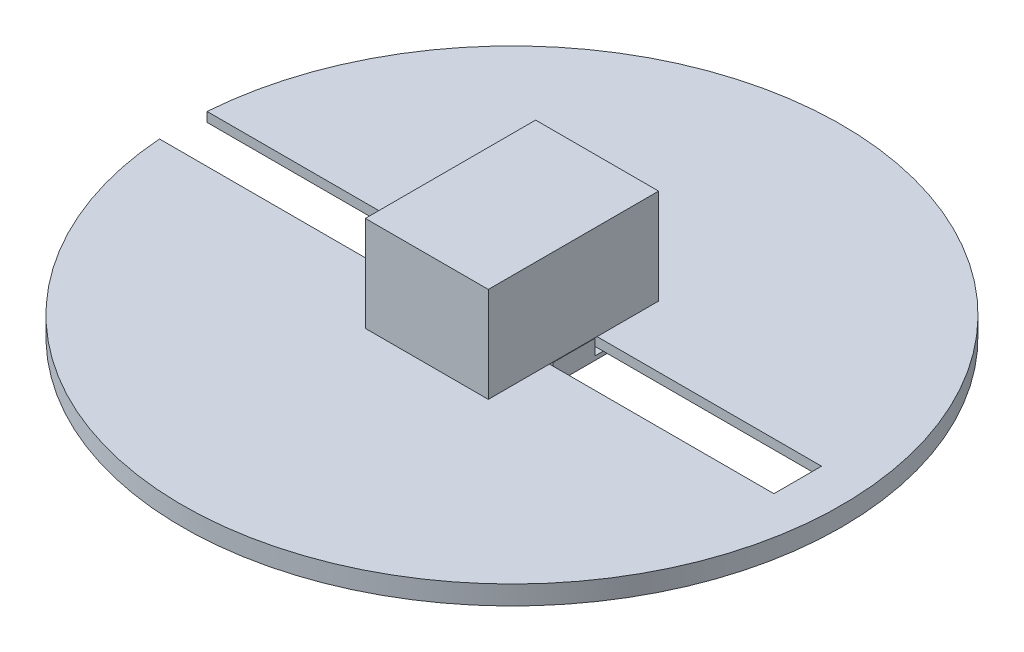
ISO-10303-21;
HEADER;
FILE_DESCRIPTION(('STEP AP214'),'2;1');
FILE_NAME('part.step','',(''),(''),'','','');
FILE_SCHEMA(('AUTOMOTIVE_DESIGN { 1 0 10303 214 1 1 1 1 }'));
ENDSEC;
DATA;
#1=APPLICATION_CONTEXT('core data for automotive mechanical design processes');
#2=APPLICATION_PROTOCOL_DEFINITION('international standard','automotive_design',2000,#1);
#3=PRODUCT_CONTEXT('',#1,'mechanical');
#4=PRODUCT('Part','Part','',(#3));
#5=PRODUCT_RELATED_PRODUCT_CATEGORY('part','',(#4));
#6=PRODUCT_DEFINITION_FORMATION('','',#4);
#7=PRODUCT_DEFINITION_CONTEXT('part definition',#1,'design');
#8=PRODUCT_DEFINITION('design','',#6,#7);
#9=PRODUCT_DEFINITION_SHAPE('','',#8);
#10=(LENGTH_UNIT() NAMED_UNIT(*) SI_UNIT(.MILLI.,.METRE.));
#11=(NAMED_UNIT(*) PLANE_ANGLE_UNIT() SI_UNIT($,.RADIAN.));
#12=(NAMED_UNIT(*) SI_UNIT($,.STERADIAN.) SOLID_ANGLE_UNIT());
#13=UNCERTAINTY_MEASURE_WITH_UNIT(LENGTH_MEASURE(1.E-05),#10,'distance_accuracy_value','');
#14=(GEOMETRIC_REPRESENTATION_CONTEXT(3) GLOBAL_UNCERTAINTY_ASSIGNED_CONTEXT((#13)) GLOBAL_UNIT_ASSIGNED_CONTEXT((#10,
#11,#12)) REPRESENTATION_CONTEXT('',''));
#15=CARTESIAN_POINT('',(0.,0.,0.));
#16=DIRECTION('',(0.,0.,1.));
#17=DIRECTION('',(1.,0.,0.));
#18=AXIS2_PLACEMENT_3D('',#15,#16,#17);
#19=CARTESIAN_POINT('',(-6.5,2.02164096303692,0.));
#20=DIRECTION('',(0.,1.,0.));
#21=DIRECTION('',(0.,0.,1.));
#22=AXIS2_PLACEMENT_3D('',#19,#20,#21);
#23=PLANE('',#22);
#24=DIRECTION('',(0.,0.,1.));
#25=VECTOR('',#24,1.);
#26=CARTESIAN_POINT('',(-6.45681258730333,2.02164096303692,-8.94020204395845));
#27=LINE('',#26,#25);
#28=CARTESIAN_POINT('',(-6.45681258730333,2.02164096303692,-2.2));
#29=VERTEX_POINT('',#28);
#30=CARTESIAN_POINT('',(-6.45681258730333,2.02164096303692,2.2));
#31=VERTEX_POINT('',#30);
#32=EDGE_CURVE('E12',#29,#31,#27,.T.);
#33=ORIENTED_EDGE('',*,*,#32,.F.);
#34=DIRECTION('',(1.,0.,0.));
#35=VECTOR('',#34,1.);
#36=CARTESIAN_POINT('',(-6.5,2.02164096303692,-2.2));
#37=LINE('',#36,#35);
#38=CARTESIAN_POINT('',(-6.5,2.02164096303692,-2.2));
#39=VERTEX_POINT('',#38);
#40=EDGE_CURVE('E243',#39,#29,#37,.T.);
#41=ORIENTED_EDGE('',*,*,#40,.F.);
#42=DIRECTION('',(0.,0.,1.));
#43=VECTOR('',#42,1.);
#44=CARTESIAN_POINT('',(-6.5,2.02164096303692,0.));
#45=LINE('',#44,#43);
#46=CARTESIAN_POINT('',(-6.5,2.02164096303692,2.2));
#47=VERTEX_POINT('',#46);
#48=EDGE_CURVE('E216',#39,#47,#45,.T.);
#49=ORIENTED_EDGE('',*,*,#48,.T.);
#50=DIRECTION('',(1.,0.,0.));
#51=VECTOR('',#50,1.);
#52=CARTESIAN_POINT('',(-6.5,2.02164096303692,2.2));
#53=LINE('',#52,#51);
#54=EDGE_CURVE('E239',#47,#31,#53,.T.);
#55=ORIENTED_EDGE('',*,*,#54,.T.);
#56=EDGE_LOOP('',(#33,#41,#49,#55));
#57=FACE_BOUND('',#56,.T.);
#58=ADVANCED_FACE('F49',(#57),#23,.T.);
#59=CARTESIAN_POINT('',(-6.5,0.,-7.2));
#60=DIRECTION('',(0.,0.,-1.));
#61=DIRECTION('',(-1.,0.,0.));
#62=AXIS2_PLACEMENT_3D('',#59,#60,#61);
#63=PLANE('',#62);
#64=DIRECTION('',(1.,0.,0.));
#65=VECTOR('',#64,1.);
#66=CARTESIAN_POINT('',(-6.5,0.421640963036902,-7.2));
#67=LINE('',#66,#65);
#68=CARTESIAN_POINT('',(-6.5,0.421640963036902,-7.2));
#69=VERTEX_POINT('',#68);
#70=CARTESIAN_POINT('',(6.5,0.421640963036902,-7.2));
#71=VERTEX_POINT('',#70);
#72=EDGE_CURVE('E53',#69,#71,#67,.T.);
#73=ORIENTED_EDGE('',*,*,#72,.T.);
#74=DIRECTION('',(0.,1.,0.));
#75=VECTOR('',#74,1.);
#76=CARTESIAN_POINT('',(6.5,0.,-7.2));
#77=LINE('',#76,#75);
#78=CARTESIAN_POINT('',(6.5,0.,-7.2));
#79=VERTEX_POINT('',#78);
#80=EDGE_CURVE('E178',#79,#71,#77,.T.);
#81=ORIENTED_EDGE('',*,*,#80,.F.);
#82=DIRECTION('',(1.,0.,0.));
#83=VECTOR('',#82,1.);
#84=CARTESIAN_POINT('',(-6.5,0.,-7.2));
#85=LINE('',#84,#83);
#86=CARTESIAN_POINT('',(-6.5,0.,-7.2));
#87=VERTEX_POINT('',#86);
#88=EDGE_CURVE('E231',#87,#79,#85,.T.);
#89=ORIENTED_EDGE('',*,*,#88,.F.);
#90=DIRECTION('',(0.,1.,0.));
#91=VECTOR('',#90,1.);
#92=CARTESIAN_POINT('',(-6.5,0.,-7.2));
#93=LINE('',#92,#91);
#94=EDGE_CURVE('E207',#87,#69,#93,.T.);
#95=ORIENTED_EDGE('',*,*,#94,.T.);
#96=EDGE_LOOP('',(#73,#81,#89,#95));
#97=FACE_BOUND('',#96,.T.);
#98=ADVANCED_FACE('F51',(#97),#63,.T.);
#99=CARTESIAN_POINT('',(-6.5,0.,0.));
#100=DIRECTION('',(0.,-1.,0.));
#101=DIRECTION('',(0.,0.,-1.));
#102=AXIS2_PLACEMENT_3D('',#99,#100,#101);
#103=PLANE('',#102);
#104=ORIENTED_EDGE('',*,*,#88,.T.);
#105=DIRECTION('',(0.,0.,-1.));
#106=VECTOR('',#105,1.);
#107=CARTESIAN_POINT('',(6.5,0.,0.));
#108=LINE('',#107,#106);
#109=CARTESIAN_POINT('',(6.5,0.,7.2));
#110=VERTEX_POINT('',#109);
#111=EDGE_CURVE('E204',#110,#79,#108,.T.);
#112=ORIENTED_EDGE('',*,*,#111,.F.);
#113=DIRECTION('',(1.,0.,0.));
#114=VECTOR('',#113,1.);
#115=CARTESIAN_POINT('',(-6.5,0.,7.2));
#116=LINE('',#115,#114);
#117=CARTESIAN_POINT('',(-6.5,0.,7.2));
#118=VERTEX_POINT('',#117);
#119=EDGE_CURVE('E233',#118,#110,#116,.T.);
#120=ORIENTED_EDGE('',*,*,#119,.F.);
#121=DIRECTION('',(0.,0.,-1.));
#122=VECTOR('',#121,1.);
#123=CARTESIAN_POINT('',(-6.5,0.,0.));
#124=LINE('',#123,#122);
#125=EDGE_CURVE('E228',#118,#87,#124,.T.);
#126=ORIENTED_EDGE('',*,*,#125,.T.);
#127=EDGE_LOOP('',(#104,#112,#120,#126));
#128=FACE_BOUND('',#127,.T.);
#129=ADVANCED_FACE('F260',(#128),#103,.T.);
#130=CARTESIAN_POINT('',(-6.5,0.,7.2));
#131=DIRECTION('',(0.,0.,1.));
#132=DIRECTION('',(1.,0.,0.));
#133=AXIS2_PLACEMENT_3D('',#130,#131,#132);
#134=PLANE('',#133);
#135=ORIENTED_EDGE('',*,*,#119,.T.);
#136=DIRECTION('',(0.,-1.,0.));
#137=VECTOR('',#136,1.);
#138=CARTESIAN_POINT('',(6.5,0.,7.2));
#139=LINE('',#138,#137);
#140=CARTESIAN_POINT('',(6.5,0.421640963036901,7.2));
#141=VERTEX_POINT('',#140);
#142=EDGE_CURVE('E201',#141,#110,#139,.T.);
#143=ORIENTED_EDGE('',*,*,#142,.F.);
#144=DIRECTION('',(1.,0.,0.));
#145=VECTOR('',#144,1.);
#146=CARTESIAN_POINT('',(-6.5,0.421640963036901,7.2));
#147=LINE('',#146,#145);
#148=CARTESIAN_POINT('',(-6.5,0.421640963036901,7.2));
#149=VERTEX_POINT('',#148);
#150=EDGE_CURVE('E235',#149,#141,#147,.T.);
#151=ORIENTED_EDGE('',*,*,#150,.F.);
#152=DIRECTION('',(0.,-1.,0.));
#153=VECTOR('',#152,1.);
#154=CARTESIAN_POINT('',(-6.5,0.,7.2));
#155=LINE('',#154,#153);
#156=EDGE_CURVE('E225',#149,#118,#155,.T.);
#157=ORIENTED_EDGE('',*,*,#156,.T.);
#158=EDGE_LOOP('',(#135,#143,#151,#157));
#159=FACE_BOUND('',#158,.T.);
#160=ADVANCED_FACE('F329',(#159),#134,.T.);
#161=CARTESIAN_POINT('',(-6.5,0.421640963036902,0.));
#162=DIRECTION('',(0.,1.,0.));
#163=DIRECTION('',(0.,0.,1.));
#164=AXIS2_PLACEMENT_3D('',#161,#162,#163);
#165=PLANE('',#164);
#166=ORIENTED_EDGE('',*,*,#150,.T.);
#167=DIRECTION('',(0.,0.,1.));
#168=VECTOR('',#167,1.);
#169=CARTESIAN_POINT('',(6.5,0.421640963036902,0.));
#170=LINE('',#169,#168);
#171=CARTESIAN_POINT('',(6.5,0.421640963036902,2.2));
#172=VERTEX_POINT('',#171);
#173=EDGE_CURVE('E198',#172,#141,#170,.T.);
#174=ORIENTED_EDGE('',*,*,#173,.F.);
#175=DIRECTION('',(1.,0.,0.));
#176=VECTOR('',#175,1.);
#177=CARTESIAN_POINT('',(-6.5,0.421640963036902,2.2));
#178=LINE('',#177,#176);
#179=CARTESIAN_POINT('',(-6.5,0.421640963036902,2.2));
#180=VERTEX_POINT('',#179);
#181=EDGE_CURVE('E237',#180,#172,#178,.T.);
#182=ORIENTED_EDGE('',*,*,#181,.F.);
#183=DIRECTION('',(0.,0.,1.));
#184=VECTOR('',#183,1.);
#185=CARTESIAN_POINT('',(-6.5,0.421640963036902,0.));
#186=LINE('',#185,#184);
#187=EDGE_CURVE('E222',#180,#149,#186,.T.);
#188=ORIENTED_EDGE('',*,*,#187,.T.);
#189=EDGE_LOOP('',(#166,#174,#182,#188));
#190=FACE_BOUND('',#189,.T.);
#191=ADVANCED_FACE('F325',(#190),#165,.T.);
#192=CARTESIAN_POINT('',(-6.5,0.,2.2));
#193=DIRECTION('',(0.,0.,1.));
#194=DIRECTION('',(1.,0.,0.));
#195=AXIS2_PLACEMENT_3D('',#192,#193,#194);
#196=PLANE('',#195);
#197=ORIENTED_EDGE('',*,*,#181,.T.);
#198=DIRECTION('',(0.,-1.,0.));
#199=VECTOR('',#198,1.);
#200=CARTESIAN_POINT('',(6.5,0.,2.2));
#201=LINE('',#200,#199);
#202=CARTESIAN_POINT('',(6.5,2.02164096303692,2.2));
#203=VERTEX_POINT('',#202);
#204=EDGE_CURVE('E195',#203,#172,#201,.T.);
#205=ORIENTED_EDGE('',*,*,#204,.F.);
#206=CARTESIAN_POINT('',(6.45681258730332,2.02164096303692,2.2));
#207=VERTEX_POINT('',#206);
#208=EDGE_CURVE('E242',#207,#203,#53,.T.);
#209=ORIENTED_EDGE('',*,*,#208,.F.);
#210=EDGE_CURVE('E241',#31,#207,#53,.T.);
#211=ORIENTED_EDGE('',*,*,#210,.F.);
#212=ORIENTED_EDGE('',*,*,#54,.F.);
#213=DIRECTION('',(0.,-1.,0.));
#214=VECTOR('',#213,1.);
#215=CARTESIAN_POINT('',(-6.5,0.,2.2));
#216=LINE('',#215,#214);
#217=EDGE_CURVE('E219',#47,#180,#216,.T.);
#218=ORIENTED_EDGE('',*,*,#217,.T.);
#219=EDGE_LOOP('',(#197,#205,#209,#211,#212,#218));
#220=FACE_BOUND('',#219,.T.);
#221=ADVANCED_FACE('F320',(#220),#196,.T.);
#222=DIRECTION('',(0.,0.,-1.));
#223=VECTOR('',#222,1.);
#224=CARTESIAN_POINT('',(6.45681258730333,2.02164096303692,-8.94020204395846));
#225=LINE('',#224,#223);
#226=CARTESIAN_POINT('',(6.45681258730333,2.02164096303692,-2.2));
#227=VERTEX_POINT('',#226);
#228=EDGE_CURVE('E58',#207,#227,#225,.T.);
#229=ORIENTED_EDGE('',*,*,#228,.F.);
#230=ORIENTED_EDGE('',*,*,#208,.T.);
#231=DIRECTION('',(0.,0.,1.));
#232=VECTOR('',#231,1.);
#233=CARTESIAN_POINT('',(6.5,2.02164096303692,0.));
#234=LINE('',#233,#232);
#235=CARTESIAN_POINT('',(6.5,2.02164096303692,-2.2));
#236=VERTEX_POINT('',#235);
#237=EDGE_CURVE('E192',#236,#203,#234,.T.);
#238=ORIENTED_EDGE('',*,*,#237,.F.);
#239=EDGE_CURVE('E245',#227,#236,#37,.T.);
#240=ORIENTED_EDGE('',*,*,#239,.F.);
#241=EDGE_LOOP('',(#229,#230,#238,#240));
#242=FACE_BOUND('',#241,.T.);
#243=ADVANCED_FACE('F273',(#242),#23,.T.);
#244=CARTESIAN_POINT('',(-6.5,0.,-2.2));
#245=DIRECTION('',(0.,0.,-1.));
#246=DIRECTION('',(-1.,0.,0.));
#247=AXIS2_PLACEMENT_3D('',#244,#245,#246);
#248=PLANE('',#247);
#249=ORIENTED_EDGE('',*,*,#40,.T.);
#250=EDGE_CURVE('E244',#29,#227,#37,.T.);
#251=ORIENTED_EDGE('',*,*,#250,.T.);
#252=ORIENTED_EDGE('',*,*,#239,.T.);
#253=DIRECTION('',(0.,1.,0.));
#254=VECTOR('',#253,1.);
#255=CARTESIAN_POINT('',(6.5,0.,-2.2));
#256=LINE('',#255,#254);
#257=CARTESIAN_POINT('',(6.5,0.421640963036902,-2.2));
#258=VERTEX_POINT('',#257);
#259=EDGE_CURVE('E189',#258,#236,#256,.T.);
#260=ORIENTED_EDGE('',*,*,#259,.F.);
#261=DIRECTION('',(1.,0.,0.));
#262=VECTOR('',#261,1.);
#263=CARTESIAN_POINT('',(-6.5,0.421640963036902,-2.2));
#264=LINE('',#263,#262);
#265=CARTESIAN_POINT('',(-6.5,0.421640963036902,-2.2));
#266=VERTEX_POINT('',#265);
#267=EDGE_CURVE('E246',#266,#258,#264,.T.);
#268=ORIENTED_EDGE('',*,*,#267,.F.);
#269=DIRECTION('',(0.,1.,0.));
#270=VECTOR('',#269,1.);
#271=CARTESIAN_POINT('',(-6.5,0.,-2.2));
#272=LINE('',#271,#270);
#273=EDGE_CURVE('E213',#266,#39,#272,.T.);
#274=ORIENTED_EDGE('',*,*,#273,.T.);
#275=EDGE_LOOP('',(#249,#251,#252,#260,#268,#274));
#276=FACE_BOUND('',#275,.T.);
#277=ADVANCED_FACE('F269',(#276),#248,.T.);
#278=CARTESIAN_POINT('',(-6.5,0.421640963036902,0.));
#279=DIRECTION('',(0.,1.,0.));
#280=DIRECTION('',(0.,0.,1.));
#281=AXIS2_PLACEMENT_3D('',#278,#279,#280);
#282=PLANE('',#281);
#283=ORIENTED_EDGE('',*,*,#267,.T.);
#284=DIRECTION('',(0.,0.,1.));
#285=VECTOR('',#284,1.);
#286=CARTESIAN_POINT('',(6.5,0.421640963036902,0.));
#287=LINE('',#286,#285);
#288=EDGE_CURVE('E181',#71,#258,#287,.T.);
#289=ORIENTED_EDGE('',*,*,#288,.F.);
#290=ORIENTED_EDGE('',*,*,#72,.F.);
#291=DIRECTION('',(0.,0.,1.));
#292=VECTOR('',#291,1.);
#293=CARTESIAN_POINT('',(-6.5,0.421640963036902,0.));
#294=LINE('',#293,#292);
#295=EDGE_CURVE('E210',#69,#266,#294,.T.);
#296=ORIENTED_EDGE('',*,*,#295,.T.);
#297=EDGE_LOOP('',(#283,#289,#290,#296));
#298=FACE_BOUND('',#297,.T.);
#299=ADVANCED_FACE('F253',(#298),#282,.T.);
#300=CARTESIAN_POINT('',(-6.5,0.,0.));
#301=DIRECTION('',(1.,0.,0.));
#302=DIRECTION('',(0.,0.,-1.));
#303=AXIS2_PLACEMENT_3D('',#300,#301,#302);
#304=PLANE('',#303);
#305=ORIENTED_EDGE('',*,*,#94,.F.);
#306=ORIENTED_EDGE('',*,*,#125,.F.);
#307=ORIENTED_EDGE('',*,*,#156,.F.);
#308=ORIENTED_EDGE('',*,*,#187,.F.);
#309=ORIENTED_EDGE('',*,*,#217,.F.);
#310=ORIENTED_EDGE('',*,*,#48,.F.);
#311=ORIENTED_EDGE('',*,*,#273,.F.);
#312=ORIENTED_EDGE('',*,*,#295,.F.);
#313=EDGE_LOOP('',(#305,#306,#307,#308,#309,#310,#311,#312));
#314=FACE_BOUND('',#313,.T.);
#315=ADVANCED_FACE('F263',(#314),#304,.F.);
#316=CARTESIAN_POINT('',(6.5,0.,0.));
#317=DIRECTION('',(1.,0.,0.));
#318=DIRECTION('',(0.,0.,-1.));
#319=AXIS2_PLACEMENT_3D('',#316,#317,#318);
#320=PLANE('',#319);
#321=ORIENTED_EDGE('',*,*,#80,.T.);
#322=ORIENTED_EDGE('',*,*,#288,.T.);
#323=ORIENTED_EDGE('',*,*,#259,.T.);
#324=ORIENTED_EDGE('',*,*,#237,.T.);
#325=ORIENTED_EDGE('',*,*,#204,.T.);
#326=ORIENTED_EDGE('',*,*,#173,.T.);
#327=ORIENTED_EDGE('',*,*,#142,.T.);
#328=ORIENTED_EDGE('',*,*,#111,.T.);
#329=EDGE_LOOP('',(#321,#322,#323,#324,#325,#326,#327,#328));
#330=FACE_BOUND('',#329,.T.);
#331=ADVANCED_FACE('F256',(#330),#320,.T.);
#332=CARTESIAN_POINT('',(0.,2.02164096303692,0.));
#333=DIRECTION('',(0.,-1.,0.));
#334=DIRECTION('',(0.,0.,-1.));
#335=AXIS2_PLACEMENT_3D('',#332,#333,#334);
#336=PLANE('',#335);
#337=ORIENTED_EDGE('',*,*,#250,.F.);
#338=CARTESIAN_POINT('',(-6.45681258730333,2.02164096303692,-8.94020204395845));
#339=VERTEX_POINT('',#338);
#340=EDGE_CURVE('E60',#339,#29,#27,.T.);
#341=ORIENTED_EDGE('',*,*,#340,.F.);
#342=DIRECTION('',(-1.,0.,0.));
#343=VECTOR('',#342,1.);
#344=CARTESIAN_POINT('',(6.45681258730333,2.02164096303692,-8.94020204395846));
#345=LINE('',#344,#343);
#346=CARTESIAN_POINT('',(6.45681258730333,2.02164096303692,-8.94020204395846));
#347=VERTEX_POINT('',#346);
#348=EDGE_CURVE('E172',#347,#339,#345,.T.);
#349=ORIENTED_EDGE('',*,*,#348,.F.);
#350=EDGE_CURVE('E284',#227,#347,#225,.T.);
#351=ORIENTED_EDGE('',*,*,#350,.F.);
#352=EDGE_LOOP('',(#337,#341,#349,#351));
#353=FACE_BOUND('',#352,.T.);
#354=ADVANCED_FACE('F298',(#353),#336,.T.);
#355=CARTESIAN_POINT('',(-6.45681258730333,12.0216409630369,-8.94020204395845));
#356=DIRECTION('',(1.,0.,0.));
#357=DIRECTION('',(0.,0.,-1.));
#358=AXIS2_PLACEMENT_3D('',#355,#356,#357);
#359=PLANE('',#358);
#360=ORIENTED_EDGE('',*,*,#340,.T.);
#361=ORIENTED_EDGE('',*,*,#32,.T.);
#362=CARTESIAN_POINT('',(-6.45681258730333,2.02164096303691,8.94020204395846));
#363=VERTEX_POINT('',#362);
#364=EDGE_CURVE('E61',#31,#363,#27,.T.);
#365=ORIENTED_EDGE('',*,*,#364,.T.);
#366=DIRECTION('',(0.,-1.,0.));
#367=VECTOR('',#366,1.);
#368=CARTESIAN_POINT('',(-6.45681258730333,12.0216409630369,8.94020204395846));
#369=LINE('',#368,#367);
#370=CARTESIAN_POINT('',(-6.45681258730333,12.0216409630369,8.94020204395846));
#371=VERTEX_POINT('',#370);
#372=EDGE_CURVE('E157',#371,#363,#369,.T.);
#373=ORIENTED_EDGE('',*,*,#372,.F.);
#374=DIRECTION('',(0.,0.,1.));
#375=VECTOR('',#374,1.);
#376=CARTESIAN_POINT('',(-6.45681258730333,12.0216409630369,-8.94020204395845));
#377=LINE('',#376,#375);
#378=CARTESIAN_POINT('',(-6.45681258730333,12.0216409630369,-8.94020204395845));
#379=VERTEX_POINT('',#378);
#380=EDGE_CURVE('E163',#379,#371,#377,.T.);
#381=ORIENTED_EDGE('',*,*,#380,.F.);
#382=DIRECTION('',(0.,-1.,0.));
#383=VECTOR('',#382,1.);
#384=CARTESIAN_POINT('',(-6.45681258730333,12.0216409630369,-8.94020204395845));
#385=LINE('',#384,#383);
#386=EDGE_CURVE('E290',#379,#339,#385,.T.);
#387=ORIENTED_EDGE('',*,*,#386,.T.);
#388=EDGE_LOOP('',(#360,#361,#365,#373,#381,#387));
#389=FACE_BOUND('',#388,.T.);
#390=ADVANCED_FACE('F175',(#389),#359,.F.);
#391=CARTESIAN_POINT('',(6.45681258730333,12.0216409630369,8.94020204395846));
#392=DIRECTION('',(0.,0.,-1.));
#393=DIRECTION('',(-1.,0.,0.));
#394=AXIS2_PLACEMENT_3D('',#391,#392,#393);
#395=PLANE('',#394);
#396=DIRECTION('',(1.,0.,0.));
#397=VECTOR('',#396,1.);
#398=CARTESIAN_POINT('',(6.45681258730333,2.02164096303691,8.94020204395846));
#399=LINE('',#398,#397);
#400=CARTESIAN_POINT('',(6.45681258730333,2.02164096303691,8.94020204395846));
#401=VERTEX_POINT('',#400);
#402=EDGE_CURVE('E287',#363,#401,#399,.T.);
#403=ORIENTED_EDGE('',*,*,#402,.T.);
#404=DIRECTION('',(0.,-1.,0.));
#405=VECTOR('',#404,1.);
#406=CARTESIAN_POINT('',(6.45681258730333,12.0216409630369,8.94020204395846));
#407=LINE('',#406,#405);
#408=CARTESIAN_POINT('',(6.45681258730333,12.0216409630369,8.94020204395846));
#409=VERTEX_POINT('',#408);
#410=EDGE_CURVE('E159',#409,#401,#407,.T.);
#411=ORIENTED_EDGE('',*,*,#410,.F.);
#412=DIRECTION('',(1.,0.,0.));
#413=VECTOR('',#412,1.);
#414=CARTESIAN_POINT('',(6.45681258730333,12.0216409630369,8.94020204395846));
#415=LINE('',#414,#413);
#416=EDGE_CURVE('E153',#371,#409,#415,.T.);
#417=ORIENTED_EDGE('',*,*,#416,.F.);
#418=ORIENTED_EDGE('',*,*,#372,.T.);
#419=EDGE_LOOP('',(#403,#411,#417,#418));
#420=FACE_BOUND('',#419,.T.);
#421=ADVANCED_FACE('F155',(#420),#395,.F.);
#422=CARTESIAN_POINT('',(6.45681258730333,12.0216409630369,-8.94020204395845));
#423=DIRECTION('',(-1.,0.,0.));
#424=DIRECTION('',(0.,0.,1.));
#425=AXIS2_PLACEMENT_3D('',#422,#423,#424);
#426=PLANE('',#425);
#427=EDGE_CURVE('E281',#401,#207,#225,.T.);
#428=ORIENTED_EDGE('',*,*,#427,.T.);
#429=ORIENTED_EDGE('',*,*,#228,.T.);
#430=ORIENTED_EDGE('',*,*,#350,.T.);
#431=DIRECTION('',(0.,-1.,0.));
#432=VECTOR('',#431,1.);
#433=CARTESIAN_POINT('',(6.45681258730333,12.0216409630369,-8.94020204395845));
#434=LINE('',#433,#432);
#435=CARTESIAN_POINT('',(6.45681258730333,12.0216409630369,-8.94020204395845));
#436=VERTEX_POINT('',#435);
#437=EDGE_CURVE('E183',#436,#347,#434,.T.);
#438=ORIENTED_EDGE('',*,*,#437,.F.);
#439=DIRECTION('',(0.,0.,-1.));
#440=VECTOR('',#439,1.);
#441=CARTESIAN_POINT('',(6.45681258730333,12.0216409630369,-8.94020204395845));
#442=LINE('',#441,#440);
#443=EDGE_CURVE('E162',#409,#436,#442,.T.);
#444=ORIENTED_EDGE('',*,*,#443,.F.);
#445=ORIENTED_EDGE('',*,*,#410,.T.);
#446=EDGE_LOOP('',(#428,#429,#430,#438,#444,#445));
#447=FACE_BOUND('',#446,.T.);
#448=ADVANCED_FACE('F283',(#447),#426,.F.);
#449=CARTESIAN_POINT('',(6.45681258730333,12.0216409630369,-8.94020204395845));
#450=DIRECTION('',(0.,0.,1.));
#451=DIRECTION('',(1.,0.,0.));
#452=AXIS2_PLACEMENT_3D('',#449,#450,#451);
#453=PLANE('',#452);
#454=ORIENTED_EDGE('',*,*,#348,.T.);
#455=ORIENTED_EDGE('',*,*,#386,.F.);
#456=DIRECTION('',(-1.,0.,0.));
#457=VECTOR('',#456,1.);
#458=CARTESIAN_POINT('',(6.45681258730333,12.0216409630369,-8.94020204395845));
#459=LINE('',#458,#457);
#460=EDGE_CURVE('E168',#436,#379,#459,.T.);
#461=ORIENTED_EDGE('',*,*,#460,.F.);
#462=ORIENTED_EDGE('',*,*,#437,.T.);
#463=EDGE_LOOP('',(#454,#455,#461,#462));
#464=FACE_BOUND('',#463,.T.);
#465=ADVANCED_FACE('F295',(#464),#453,.F.);
#466=CARTESIAN_POINT('',(0.,12.0216409630369,0.));
#467=DIRECTION('',(0.,-1.,0.));
#468=DIRECTION('',(0.,0.,-1.));
#469=AXIS2_PLACEMENT_3D('',#466,#467,#468);
#470=PLANE('',#469);
#471=ORIENTED_EDGE('',*,*,#380,.T.);
#472=ORIENTED_EDGE('',*,*,#416,.T.);
#473=ORIENTED_EDGE('',*,*,#443,.T.);
#474=ORIENTED_EDGE('',*,*,#460,.T.);
#475=EDGE_LOOP('',(#471,#472,#473,#474));
#476=FACE_BOUND('',#475,.T.);
#477=ADVANCED_FACE('F166',(#476),#470,.F.);
#478=ORIENTED_EDGE('',*,*,#364,.F.);
#479=ORIENTED_EDGE('',*,*,#210,.T.);
#480=ORIENTED_EDGE('',*,*,#427,.F.);
#481=ORIENTED_EDGE('',*,*,#402,.F.);
#482=EDGE_LOOP('',(#478,#479,#480,#481));
#483=FACE_BOUND('',#482,.T.);
#484=ADVANCED_FACE('F280',(#483),#336,.T.);
#485=CLOSED_SHELL('',(#58,#98,#129,#160,#191,#221,#243,#277,#299,#315,#331,#354,#390,#421,#448,
#465,#477,#484));
#486=MANIFOLD_SOLID_BREP('B2',#485);
#487=CARTESIAN_POINT('',(0.,2.,0.));
#488=DIRECTION('',(0.,-1.,0.));
#489=DIRECTION('',(0.,0.,-1.));
#490=AXIS2_PLACEMENT_3D('',#487,#488,#489);
#491=CYLINDRICAL_SURFACE('',#490,34.6);
#492=DIRECTION('',(0.,-1.,0.));
#493=VECTOR('',#492,1.);
#494=CARTESIAN_POINT('',(-34.5095638917678,2.,2.5));
#495=LINE('',#494,#493);
#496=CARTESIAN_POINT('',(-34.5095638917678,0.999999999999993,2.5));
#497=VERTEX_POINT('',#496);
#498=CARTESIAN_POINT('',(-34.5095638917677,2.00000000000001,2.5));
#499=VERTEX_POINT('',#498);
#500=EDGE_CURVE('E597',#497,#499,#495,.F.);
#501=ORIENTED_EDGE('',*,*,#500,.F.);
#502=CARTESIAN_POINT('',(0.,0.999999999999994,0.));
#503=DIRECTION('',(0.,-1.,0.));
#504=DIRECTION('',(0.,0.,-1.));
#505=AXIS2_PLACEMENT_3D('',#502,#503,#504);
#506=CIRCLE('',#505,34.6);
#507=CARTESIAN_POINT('',(-33.7773592810332,0.999999999999993,7.5));
#508=VERTEX_POINT('',#507);
#509=EDGE_CURVE('E47',#508,#497,#506,.T.);
#510=ORIENTED_EDGE('',*,*,#509,.F.);
#511=DIRECTION('',(0.,-1.,0.));
#512=VECTOR('',#511,1.);
#513=CARTESIAN_POINT('',(-33.7773592810332,2.,7.5));
#514=LINE('',#513,#512);
#515=CARTESIAN_POINT('',(-33.7773592810332,0.830383356914064,7.5));
#516=VERTEX_POINT('',#515);
#517=EDGE_CURVE('E595',#516,#508,#514,.F.);
#518=ORIENTED_EDGE('',*,*,#517,.F.);
#519=CARTESIAN_POINT('',(0.,-6.1340206185567,0.));
#520=DIRECTION('',(0.201937803647438,0.979398347690075,0.));
#521=DIRECTION('',(0.979398347690075,-0.201937803647438,0.));
#522=AXIS2_PLACEMENT_3D('',#519,#520,#521);
#523=ELLIPSE('',#522,35.3278112849635,34.6);
#524=CARTESIAN_POINT('',(-29.75,0.,17.666281442341));
#525=VERTEX_POINT('',#524);
#526=EDGE_CURVE('E600',#516,#525,#523,.T.);
#527=ORIENTED_EDGE('',*,*,#526,.T.);
#528=CARTESIAN_POINT('',(0.,0.,0.));
#529=DIRECTION('',(0.,1.,0.));
#530=DIRECTION('',(0.,0.,1.));
#531=AXIS2_PLACEMENT_3D('',#528,#529,#530);
#532=CIRCLE('',#531,34.6);
#533=CARTESIAN_POINT('',(-29.75,0.,-17.666281442341));
#534=VERTEX_POINT('',#533);
#535=EDGE_CURVE('E604',#525,#534,#532,.T.);
#536=ORIENTED_EDGE('',*,*,#535,.T.);
#537=CARTESIAN_POINT('',(-33.7773592810332,0.830383356914064,-7.5));
#538=VERTEX_POINT('',#537);
#539=EDGE_CURVE('E601',#534,#538,#523,.T.);
#540=ORIENTED_EDGE('',*,*,#539,.T.);
#541=DIRECTION('',(0.,-1.,0.));
#542=VECTOR('',#541,1.);
#543=CARTESIAN_POINT('',(-33.7773592810332,2.,-7.5));
#544=LINE('',#543,#542);
#545=CARTESIAN_POINT('',(-33.7773592810332,0.999999999999993,-7.5));
#546=VERTEX_POINT('',#545);
#547=EDGE_CURVE('E477',#546,#538,#544,.T.);
#548=ORIENTED_EDGE('',*,*,#547,.F.);
#549=CARTESIAN_POINT('',(0.,0.999999999999994,0.));
#550=DIRECTION('',(0.,1.,0.));
#551=DIRECTION('',(0.,0.,1.));
#552=AXIS2_PLACEMENT_3D('',#549,#550,#551);
#553=CIRCLE('',#552,34.6);
#554=CARTESIAN_POINT('',(-34.5095638917678,0.999999999999993,-2.5));
#555=VERTEX_POINT('',#554);
#556=EDGE_CURVE('E470',#546,#555,#553,.T.);
#557=ORIENTED_EDGE('',*,*,#556,.T.);
#558=DIRECTION('',(0.,-1.,0.));
#559=VECTOR('',#558,1.);
#560=CARTESIAN_POINT('',(-34.5095638917678,2.,-2.5));
#561=LINE('',#560,#559);
#562=CARTESIAN_POINT('',(-34.5095638917677,2.00000000000001,-2.5));
#563=VERTEX_POINT('',#562);
#564=EDGE_CURVE('E547',#555,#563,#561,.F.);
#565=ORIENTED_EDGE('',*,*,#564,.T.);
#566=CARTESIAN_POINT('',(0.,2.,0.));
#567=DIRECTION('',(0.,1.,0.));
#568=DIRECTION('',(0.,0.,1.));
#569=AXIS2_PLACEMENT_3D('',#566,#567,#568);
#570=CIRCLE('',#569,34.6);
#571=EDGE_CURVE('E605',#499,#563,#570,.T.);
#572=ORIENTED_EDGE('',*,*,#571,.F.);
#573=EDGE_LOOP('',(#501,#510,#518,#527,#536,#540,#548,#557,#565,#572));
#574=FACE_BOUND('',#573,.T.);
#575=ADVANCED_FACE('F463',(#574),#491,.T.);
#576=CARTESIAN_POINT('',(0.,0.,0.));
#577=DIRECTION('',(0.,1.,0.));
#578=DIRECTION('',(0.,0.,1.));
#579=AXIS2_PLACEMENT_3D('',#576,#577,#578);
#580=PLANE('',#579);
#581=DIRECTION('',(-1.,0.,0.));
#582=VECTOR('',#581,1.);
#583=CARTESIAN_POINT('',(30.,0.,7.5));
#584=LINE('',#583,#582);
#585=CARTESIAN_POINT('',(30.,0.,7.5));
#586=VERTEX_POINT('',#585);
#587=CARTESIAN_POINT('',(-29.75,0.,7.5));
#588=VERTEX_POINT('',#587);
#589=EDGE_CURVE('E589',#586,#588,#584,.T.);
#590=ORIENTED_EDGE('',*,*,#589,.F.);
#591=DIRECTION('',(0.,0.,-1.));
#592=VECTOR('',#591,1.);
#593=CARTESIAN_POINT('',(30.,0.,7.5));
#594=LINE('',#593,#592);
#595=CARTESIAN_POINT('',(30.,0.,-7.5));
#596=VERTEX_POINT('',#595);
#597=EDGE_CURVE('E568',#586,#596,#594,.T.);
#598=ORIENTED_EDGE('',*,*,#597,.T.);
#599=DIRECTION('',(-1.,0.,0.));
#600=VECTOR('',#599,1.);
#601=CARTESIAN_POINT('',(30.,0.,-7.5));
#602=LINE('',#601,#600);
#603=CARTESIAN_POINT('',(-29.7499999999996,0.,-7.5));
#604=VERTEX_POINT('',#603);
#605=EDGE_CURVE('E591',#596,#604,#602,.T.);
#606=ORIENTED_EDGE('',*,*,#605,.T.);
#607=DIRECTION('',(0.,0.,-1.));
#608=VECTOR('',#607,1.);
#609=CARTESIAN_POINT('',(-29.75,0.,0.));
#610=LINE('',#609,#608);
#611=EDGE_CURVE('E485',#604,#534,#610,.T.);
#612=ORIENTED_EDGE('',*,*,#611,.T.);
#613=ORIENTED_EDGE('',*,*,#535,.F.);
#614=EDGE_CURVE('E610',#525,#588,#610,.T.);
#615=ORIENTED_EDGE('',*,*,#614,.T.);
#616=EDGE_LOOP('',(#590,#598,#606,#612,#613,#615));
#617=FACE_BOUND('',#616,.T.);
#618=ADVANCED_FACE('F623',(#617),#580,.F.);
#619=CARTESIAN_POINT('',(-34.6,1.,22.));
#620=DIRECTION('',(0.201937803647438,0.979398347690075,0.));
#621=DIRECTION('',(-0.979398347690075,0.201937803647438,0.));
#622=AXIS2_PLACEMENT_3D('',#619,#620,#621);
#623=PLANE('',#622);
#624=DIRECTION('',(-0.979398347690075,0.201937803647438,0.));
#625=VECTOR('',#624,1.);
#626=CARTESIAN_POINT('',(-34.6,1.,7.5));
#627=LINE('',#626,#625);
#628=EDGE_CURVE('E615',#588,#516,#627,.T.);
#629=ORIENTED_EDGE('',*,*,#628,.F.);
#630=ORIENTED_EDGE('',*,*,#614,.F.);
#631=ORIENTED_EDGE('',*,*,#526,.F.);
#632=EDGE_LOOP('',(#629,#630,#631));
#633=FACE_BOUND('',#632,.T.);
#634=ADVANCED_FACE('F632',(#633),#623,.F.);
#635=DIRECTION('',(0.979398347690075,-0.201937803647438,0.));
#636=VECTOR('',#635,1.);
#637=CARTESIAN_POINT('',(-34.6,1.,-7.5));
#638=LINE('',#637,#636);
#639=EDGE_CURVE('E613',#538,#604,#638,.T.);
#640=ORIENTED_EDGE('',*,*,#639,.F.);
#641=ORIENTED_EDGE('',*,*,#539,.F.);
#642=ORIENTED_EDGE('',*,*,#611,.F.);
#643=EDGE_LOOP('',(#640,#641,#642));
#644=FACE_BOUND('',#643,.T.);
#645=ADVANCED_FACE('F659',(#644),#623,.F.);
#646=CARTESIAN_POINT('',(0.,2.,0.));
#647=DIRECTION('',(0.,1.,0.));
#648=DIRECTION('',(0.,0.,1.));
#649=AXIS2_PLACEMENT_3D('',#646,#647,#648);
#650=PLANE('',#649);
#651=DIRECTION('',(-1.,0.,0.));
#652=VECTOR('',#651,1.);
#653=CARTESIAN_POINT('',(30.,2.00000000000001,-2.5));
#654=LINE('',#653,#652);
#655=CARTESIAN_POINT('',(30.,2.00000000000001,-2.5));
#656=VERTEX_POINT('',#655);
#657=EDGE_CURVE('E578',#656,#563,#654,.T.);
#658=ORIENTED_EDGE('',*,*,#657,.F.);
#659=DIRECTION('',(0.,0.,-1.));
#660=VECTOR('',#659,1.);
#661=CARTESIAN_POINT('',(30.,2.00000000000001,2.5));
#662=LINE('',#661,#660);
#663=CARTESIAN_POINT('',(30.,2.00000000000001,2.5));
#664=VERTEX_POINT('',#663);
#665=EDGE_CURVE('E551',#664,#656,#662,.T.);
#666=ORIENTED_EDGE('',*,*,#665,.F.);
#667=DIRECTION('',(-1.,0.,0.));
#668=VECTOR('',#667,1.);
#669=CARTESIAN_POINT('',(30.,2.00000000000001,2.5));
#670=LINE('',#669,#668);
#671=EDGE_CURVE('E580',#664,#499,#670,.T.);
#672=ORIENTED_EDGE('',*,*,#671,.T.);
#673=ORIENTED_EDGE('',*,*,#571,.T.);
#674=EDGE_LOOP('',(#658,#666,#672,#673));
#675=FACE_BOUND('',#674,.T.);
#676=ADVANCED_FACE('F640',(#675),#650,.T.);
#677=CARTESIAN_POINT('',(30.,0.999999999999993,2.5));
#678=DIRECTION('',(0.,-1.,0.));
#679=DIRECTION('',(0.,0.,-1.));
#680=AXIS2_PLACEMENT_3D('',#677,#678,#679);
#681=PLANE('',#680);
#682=ORIENTED_EDGE('',*,*,#509,.T.);
#683=DIRECTION('',(-1.,0.,0.));
#684=VECTOR('',#683,1.);
#685=CARTESIAN_POINT('',(30.,0.999999999999993,2.5));
#686=LINE('',#685,#684);
#687=CARTESIAN_POINT('',(30.,0.999999999999993,2.5));
#688=VERTEX_POINT('',#687);
#689=EDGE_CURVE('E583',#688,#497,#686,.T.);
#690=ORIENTED_EDGE('',*,*,#689,.F.);
#691=DIRECTION('',(0.,0.,1.));
#692=VECTOR('',#691,1.);
#693=CARTESIAN_POINT('',(30.,0.999999999999993,2.5));
#694=LINE('',#693,#692);
#695=CARTESIAN_POINT('',(30.,0.999999999999993,7.5));
#696=VERTEX_POINT('',#695);
#697=EDGE_CURVE('E573',#688,#696,#694,.T.);
#698=ORIENTED_EDGE('',*,*,#697,.T.);
#699=DIRECTION('',(-1.,0.,0.));
#700=VECTOR('',#699,1.);
#701=CARTESIAN_POINT('',(30.,0.999999999999993,7.5));
#702=LINE('',#701,#700);
#703=EDGE_CURVE('E586',#696,#508,#702,.T.);
#704=ORIENTED_EDGE('',*,*,#703,.T.);
#705=EDGE_LOOP('',(#682,#690,#698,#704));
#706=FACE_BOUND('',#705,.T.);
#707=ADVANCED_FACE('F635',(#706),#681,.T.);
#708=CARTESIAN_POINT('',(30.,0.999999999999993,-2.5));
#709=DIRECTION('',(0.,1.,0.));
#710=DIRECTION('',(0.,0.,1.));
#711=AXIS2_PLACEMENT_3D('',#708,#709,#710);
#712=PLANE('',#711);
#713=DIRECTION('',(-1.,0.,0.));
#714=VECTOR('',#713,1.);
#715=CARTESIAN_POINT('',(30.,0.999999999999993,-7.5));
#716=LINE('',#715,#714);
#717=CARTESIAN_POINT('',(30.,0.999999999999993,-7.5));
#718=VERTEX_POINT('',#717);
#719=EDGE_CURVE('E550',#718,#546,#716,.T.);
#720=ORIENTED_EDGE('',*,*,#719,.F.);
#721=DIRECTION('',(0.,0.,-1.));
#722=VECTOR('',#721,1.);
#723=CARTESIAN_POINT('',(30.,0.999999999999993,-2.5));
#724=LINE('',#723,#722);
#725=CARTESIAN_POINT('',(30.,0.999999999999993,-2.5));
#726=VERTEX_POINT('',#725);
#727=EDGE_CURVE('E555',#726,#718,#724,.T.);
#728=ORIENTED_EDGE('',*,*,#727,.F.);
#729=DIRECTION('',(-1.,0.,0.));
#730=VECTOR('',#729,1.);
#731=CARTESIAN_POINT('',(30.,0.999999999999993,-2.5));
#732=LINE('',#731,#730);
#733=EDGE_CURVE('E540',#726,#555,#732,.T.);
#734=ORIENTED_EDGE('',*,*,#733,.T.);
#735=ORIENTED_EDGE('',*,*,#556,.F.);
#736=EDGE_LOOP('',(#720,#728,#734,#735));
#737=FACE_BOUND('',#736,.T.);
#738=ADVANCED_FACE('F556',(#737),#712,.F.);
#739=CARTESIAN_POINT('',(30.,2.00000000000001,-2.5));
#740=DIRECTION('',(0.,0.,-1.));
#741=DIRECTION('',(0.,1.,0.));
#742=AXIS2_PLACEMENT_3D('',#739,#740,#741);
#743=PLANE('',#742);
#744=ORIENTED_EDGE('',*,*,#733,.F.);
#745=DIRECTION('',(0.,-1.,0.));
#746=VECTOR('',#745,1.);
#747=CARTESIAN_POINT('',(30.,2.00000000000001,-2.5));
#748=LINE('',#747,#746);
#749=EDGE_CURVE('E544',#656,#726,#748,.T.);
#750=ORIENTED_EDGE('',*,*,#749,.F.);
#751=ORIENTED_EDGE('',*,*,#657,.T.);
#752=ORIENTED_EDGE('',*,*,#564,.F.);
#753=EDGE_LOOP('',(#744,#750,#751,#752));
#754=FACE_BOUND('',#753,.T.);
#755=ADVANCED_FACE('F542',(#754),#743,.F.);
#756=CARTESIAN_POINT('',(30.,2.00000000000001,2.5));
#757=DIRECTION('',(0.,0.,-1.));
#758=DIRECTION('',(0.,1.,0.));
#759=AXIS2_PLACEMENT_3D('',#756,#757,#758);
#760=PLANE('',#759);
#761=ORIENTED_EDGE('',*,*,#500,.T.);
#762=ORIENTED_EDGE('',*,*,#671,.F.);
#763=DIRECTION('',(0.,-1.,0.));
#764=VECTOR('',#763,1.);
#765=CARTESIAN_POINT('',(30.,2.00000000000001,2.5));
#766=LINE('',#765,#764);
#767=EDGE_CURVE('E575',#664,#688,#766,.T.);
#768=ORIENTED_EDGE('',*,*,#767,.T.);
#769=ORIENTED_EDGE('',*,*,#689,.T.);
#770=EDGE_LOOP('',(#761,#762,#768,#769));
#771=FACE_BOUND('',#770,.T.);
#772=ADVANCED_FACE('F641',(#771),#760,.T.);
#773=CARTESIAN_POINT('',(30.,0.999999999999993,7.5));
#774=DIRECTION('',(0.,0.,-1.));
#775=DIRECTION('',(-1.,0.,0.));
#776=AXIS2_PLACEMENT_3D('',#773,#774,#775);
#777=PLANE('',#776);
#778=ORIENTED_EDGE('',*,*,#517,.T.);
#779=ORIENTED_EDGE('',*,*,#703,.F.);
#780=DIRECTION('',(0.,-1.,0.));
#781=VECTOR('',#780,1.);
#782=CARTESIAN_POINT('',(30.,0.999999999999993,7.5));
#783=LINE('',#782,#781);
#784=EDGE_CURVE('E571',#696,#586,#783,.T.);
#785=ORIENTED_EDGE('',*,*,#784,.T.);
#786=ORIENTED_EDGE('',*,*,#589,.T.);
#787=ORIENTED_EDGE('',*,*,#628,.T.);
#788=EDGE_LOOP('',(#778,#779,#785,#786,#787));
#789=FACE_BOUND('',#788,.T.);
#790=ADVANCED_FACE('F627',(#789),#777,.T.);
#791=CARTESIAN_POINT('',(30.,0.,-7.5));
#792=DIRECTION('',(0.,0.,1.));
#793=DIRECTION('',(1.,0.,0.));
#794=AXIS2_PLACEMENT_3D('',#791,#792,#793);
#795=PLANE('',#794);
#796=ORIENTED_EDGE('',*,*,#547,.T.);
#797=ORIENTED_EDGE('',*,*,#639,.T.);
#798=ORIENTED_EDGE('',*,*,#605,.F.);
#799=DIRECTION('',(0.,1.,0.));
#800=VECTOR('',#799,1.);
#801=CARTESIAN_POINT('',(30.,0.,-7.5));
#802=LINE('',#801,#800);
#803=EDGE_CURVE('E559',#596,#718,#802,.T.);
#804=ORIENTED_EDGE('',*,*,#803,.T.);
#805=ORIENTED_EDGE('',*,*,#719,.T.);
#806=EDGE_LOOP('',(#796,#797,#798,#804,#805));
#807=FACE_BOUND('',#806,.T.);
#808=ADVANCED_FACE('F619',(#807),#795,.T.);
#809=CARTESIAN_POINT('',(30.,0.,0.));
#810=DIRECTION('',(1.,0.,0.));
#811=DIRECTION('',(0.,0.,-1.));
#812=AXIS2_PLACEMENT_3D('',#809,#810,#811);
#813=PLANE('',#812);
#814=ORIENTED_EDGE('',*,*,#749,.T.);
#815=ORIENTED_EDGE('',*,*,#727,.T.);
#816=ORIENTED_EDGE('',*,*,#803,.F.);
#817=ORIENTED_EDGE('',*,*,#597,.F.);
#818=ORIENTED_EDGE('',*,*,#784,.F.);
#819=ORIENTED_EDGE('',*,*,#697,.F.);
#820=ORIENTED_EDGE('',*,*,#767,.F.);
#821=ORIENTED_EDGE('',*,*,#665,.T.);
#822=EDGE_LOOP('',(#814,#815,#816,#817,#818,#819,#820,#821));
#823=FACE_BOUND('',#822,.T.);
#824=ADVANCED_FACE('F561',(#823),#813,.F.);
#825=CLOSED_SHELL('',(#575,#618,#634,#645,#676,#707,#738,#755,#772,#790,#808,#824));
#826=MANIFOLD_SOLID_BREP('B6',#825);
#827=ADVANCED_BREP_SHAPE_REPRESENTATION('',(#18,#486,#826),#14);
#828=SHAPE_DEFINITION_REPRESENTATION(#9,#827);
ENDSEC;
END-ISO-10303-21;
